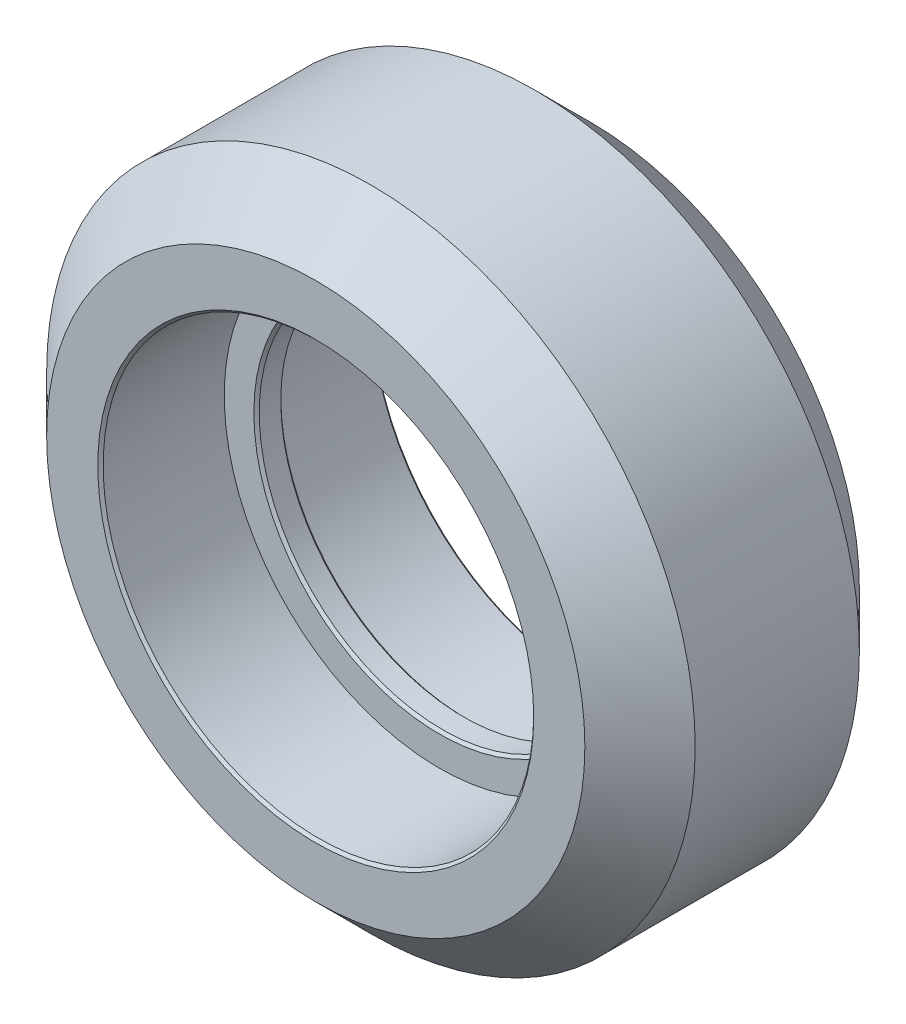
ISO-10303-21;
HEADER;
FILE_DESCRIPTION(('STEP AP214'),'2;1');
FILE_NAME('part.step','',(''),(''),'','','');
FILE_SCHEMA(('AUTOMOTIVE_DESIGN { 1 0 10303 214 1 1 1 1 }'));
ENDSEC;
DATA;
#1=APPLICATION_CONTEXT('core data for automotive mechanical design processes');
#2=APPLICATION_PROTOCOL_DEFINITION('international standard','automotive_design',2000,#1);
#3=PRODUCT_CONTEXT('',#1,'mechanical');
#4=PRODUCT('Part','Part','',(#3));
#5=PRODUCT_RELATED_PRODUCT_CATEGORY('part','',(#4));
#6=PRODUCT_DEFINITION_FORMATION('','',#4);
#7=PRODUCT_DEFINITION_CONTEXT('part definition',#1,'design');
#8=PRODUCT_DEFINITION('design','',#6,#7);
#9=PRODUCT_DEFINITION_SHAPE('','',#8);
#10=(LENGTH_UNIT() NAMED_UNIT(*) SI_UNIT(.MILLI.,.METRE.));
#11=(NAMED_UNIT(*) PLANE_ANGLE_UNIT() SI_UNIT($,.RADIAN.));
#12=(NAMED_UNIT(*) SI_UNIT($,.STERADIAN.) SOLID_ANGLE_UNIT());
#13=UNCERTAINTY_MEASURE_WITH_UNIT(LENGTH_MEASURE(1.E-05),#10,'distance_accuracy_value','');
#14=(GEOMETRIC_REPRESENTATION_CONTEXT(3) GLOBAL_UNCERTAINTY_ASSIGNED_CONTEXT((#13)) GLOBAL_UNIT_ASSIGNED_CONTEXT((#10,
#11,#12)) REPRESENTATION_CONTEXT('',''));
#15=CARTESIAN_POINT('',(0.,0.,0.));
#16=DIRECTION('',(0.,0.,1.));
#17=DIRECTION('',(1.,0.,0.));
#18=AXIS2_PLACEMENT_3D('',#15,#16,#17);
#19=CARTESIAN_POINT('',(15.5,-35.5,-38.35));
#20=DIRECTION('',(0.,0.,1.));
#21=DIRECTION('',(1.,0.,0.));
#22=AXIS2_PLACEMENT_3D('',#19,#20,#21);
#23=CYLINDRICAL_SURFACE('',#22,6.8);
#24=CARTESIAN_POINT('',(15.5,-35.5,-13.8499999999908));
#25=DIRECTION('',(0.,0.,-1.));
#26=DIRECTION('',(-1.,0.,0.));
#27=AXIS2_PLACEMENT_3D('',#24,#25,#26);
#28=CIRCLE('',#27,6.79999999991014);
#29=CARTESIAN_POINT('',(8.70000000008986,-35.5,-13.8499999999908));
#30=VERTEX_POINT('',#29);
#31=EDGE_CURVE('E42',#30,#30,#28,.T.);
#32=ORIENTED_EDGE('',*,*,#31,.T.);
#33=EDGE_LOOP('',(#32));
#34=FACE_BOUND('',#33,.T.);
#35=CARTESIAN_POINT('',(15.5,-35.5,-13.0500000000211));
#36=DIRECTION('',(0.,0.,1.));
#37=DIRECTION('',(1.,0.,0.));
#38=AXIS2_PLACEMENT_3D('',#35,#36,#37);
#39=CIRCLE('',#38,6.7999999999729);
#40=CARTESIAN_POINT('',(22.2999999999729,-35.5,-13.0500000000211));
#41=VERTEX_POINT('',#40);
#42=EDGE_CURVE('E39',#41,#41,#39,.T.);
#43=ORIENTED_EDGE('',*,*,#42,.T.);
#44=EDGE_LOOP('',(#43));
#45=FACE_BOUND('',#44,.T.);
#46=ADVANCED_FACE('F16',(#34,#45),#23,.F.);
#47=CARTESIAN_POINT('',(15.5,-35.5,-13.9499999999089));
#48=DIRECTION('',(0.,0.,-1.));
#49=DIRECTION('',(-1.,0.,0.));
#50=AXIS2_PLACEMENT_3D('',#47,#48,#49);
#51=CONICAL_SURFACE('',#50,6.8999999998282,0.785398163397448);
#52=ORIENTED_EDGE('',*,*,#31,.F.);
#53=EDGE_LOOP('',(#52));
#54=FACE_BOUND('',#53,.T.);
#55=CARTESIAN_POINT('',(15.5,-35.5,-13.9500000000226));
#56=DIRECTION('',(0.,0.,-1.));
#57=DIRECTION('',(-1.,0.,0.));
#58=AXIS2_PLACEMENT_3D('',#55,#56,#57);
#59=CIRCLE('',#58,6.89999999994188);
#60=CARTESIAN_POINT('',(8.60000000005812,-35.5,-13.9500000000226));
#61=VERTEX_POINT('',#60);
#62=EDGE_CURVE('E19',#61,#61,#59,.F.);
#63=ORIENTED_EDGE('',*,*,#62,.F.);
#64=EDGE_LOOP('',(#63));
#65=FACE_BOUND('',#64,.T.);
#66=ADVANCED_FACE('F68',(#54,#65),#51,.F.);
#67=CARTESIAN_POINT('',(15.5,-35.5,-12.950000000103));
#68=DIRECTION('',(0.,0.,1.));
#69=DIRECTION('',(1.,0.,0.));
#70=AXIS2_PLACEMENT_3D('',#67,#68,#69);
#71=CONICAL_SURFACE('',#70,6.89999999989095,0.785398163397448);
#72=ORIENTED_EDGE('',*,*,#42,.F.);
#73=EDGE_LOOP('',(#72));
#74=FACE_BOUND('',#73,.T.);
#75=CARTESIAN_POINT('',(15.5,-35.5,-12.9499999999894));
#76=DIRECTION('',(0.,0.,1.));
#77=DIRECTION('',(1.,0.,0.));
#78=AXIS2_PLACEMENT_3D('',#75,#76,#77);
#79=CIRCLE('',#78,6.90000000000464);
#80=CARTESIAN_POINT('',(22.4000000000046,-35.5,-12.9499999999894));
#81=VERTEX_POINT('',#80);
#82=EDGE_CURVE('E59',#81,#81,#79,.F.);
#83=ORIENTED_EDGE('',*,*,#82,.F.);
#84=EDGE_LOOP('',(#83));
#85=FACE_BOUND('',#84,.T.);
#86=ADVANCED_FACE('F70',(#74,#85),#71,.F.);
#87=CARTESIAN_POINT('',(15.5,-35.5,-13.95));
#88=DIRECTION('',(0.,0.,-1.));
#89=DIRECTION('',(-1.,0.,0.));
#90=AXIS2_PLACEMENT_3D('',#87,#88,#89);
#91=PLANE('',#90);
#92=CARTESIAN_POINT('',(15.5,-35.5,-13.95));
#93=DIRECTION('',(0.,0.,-1.));
#94=DIRECTION('',(-1.,0.,0.));
#95=AXIS2_PLACEMENT_3D('',#92,#93,#94);
#96=CIRCLE('',#95,8.);
#97=CARTESIAN_POINT('',(7.5,-35.5,-13.95));
#98=VERTEX_POINT('',#97);
#99=EDGE_CURVE('E57',#98,#98,#96,.T.);
#100=ORIENTED_EDGE('',*,*,#99,.T.);
#101=EDGE_LOOP('',(#100));
#102=FACE_BOUND('',#101,.T.);
#103=ORIENTED_EDGE('',*,*,#62,.T.);
#104=EDGE_LOOP('',(#103));
#105=FACE_BOUND('',#104,.T.);
#106=ADVANCED_FACE('F66',(#102,#105),#91,.T.);
#107=CARTESIAN_POINT('',(15.5,-35.5,-12.95));
#108=DIRECTION('',(0.,0.,1.));
#109=DIRECTION('',(1.,0.,0.));
#110=AXIS2_PLACEMENT_3D('',#107,#108,#109);
#111=PLANE('',#110);
#112=CARTESIAN_POINT('',(15.5,-35.5,-12.95));
#113=DIRECTION('',(0.,0.,1.));
#114=DIRECTION('',(1.,0.,0.));
#115=AXIS2_PLACEMENT_3D('',#112,#113,#114);
#116=CIRCLE('',#115,8.);
#117=CARTESIAN_POINT('',(23.5,-35.5,-12.95));
#118=VERTEX_POINT('',#117);
#119=EDGE_CURVE('E38',#118,#118,#116,.T.);
#120=ORIENTED_EDGE('',*,*,#119,.T.);
#121=EDGE_LOOP('',(#120));
#122=FACE_BOUND('',#121,.T.);
#123=ORIENTED_EDGE('',*,*,#82,.T.);
#124=EDGE_LOOP('',(#123));
#125=FACE_BOUND('',#124,.T.);
#126=ADVANCED_FACE('F119',(#122,#125),#111,.T.);
#127=CARTESIAN_POINT('',(15.5,-35.5,-13.95));
#128=DIRECTION('',(0.,0.,-1.));
#129=DIRECTION('',(-1.,0.,0.));
#130=AXIS2_PLACEMENT_3D('',#127,#128,#129);
#131=CYLINDRICAL_SURFACE('',#130,8.);
#132=CARTESIAN_POINT('',(15.5,-35.5,-18.45));
#133=DIRECTION('',(0.,0.,-1.));
#134=DIRECTION('',(-1.,0.,0.));
#135=AXIS2_PLACEMENT_3D('',#132,#133,#134);
#136=CIRCLE('',#135,8.);
#137=CARTESIAN_POINT('',(7.5,-35.5,-18.45));
#138=VERTEX_POINT('',#137);
#139=EDGE_CURVE('E35',#138,#138,#136,.T.);
#140=ORIENTED_EDGE('',*,*,#139,.T.);
#141=EDGE_LOOP('',(#140));
#142=FACE_BOUND('',#141,.T.);
#143=ORIENTED_EDGE('',*,*,#99,.F.);
#144=EDGE_LOOP('',(#143));
#145=FACE_BOUND('',#144,.T.);
#146=ADVANCED_FACE('F115',(#142,#145),#131,.F.);
#147=CARTESIAN_POINT('',(15.5,-35.5,-12.95));
#148=DIRECTION('',(0.,0.,1.));
#149=DIRECTION('',(1.,0.,0.));
#150=AXIS2_PLACEMENT_3D('',#147,#148,#149);
#151=CYLINDRICAL_SURFACE('',#150,8.);
#152=ORIENTED_EDGE('',*,*,#119,.F.);
#153=EDGE_LOOP('',(#152));
#154=FACE_BOUND('',#153,.T.);
#155=CARTESIAN_POINT('',(15.5,-35.5,-8.45));
#156=DIRECTION('',(0.,0.,1.));
#157=DIRECTION('',(1.,0.,0.));
#158=AXIS2_PLACEMENT_3D('',#155,#156,#157);
#159=CIRCLE('',#158,8.);
#160=CARTESIAN_POINT('',(23.5,-35.5,-8.45));
#161=VERTEX_POINT('',#160);
#162=EDGE_CURVE('E31',#161,#161,#159,.T.);
#163=ORIENTED_EDGE('',*,*,#162,.T.);
#164=EDGE_LOOP('',(#163));
#165=FACE_BOUND('',#164,.T.);
#166=ADVANCED_FACE('F111',(#154,#165),#151,.F.);
#167=CARTESIAN_POINT('',(15.5,-35.5,-18.55));
#168=DIRECTION('',(0.,0.,-1.));
#169=DIRECTION('',(-1.,0.,0.));
#170=AXIS2_PLACEMENT_3D('',#167,#168,#169);
#171=CONICAL_SURFACE('',#170,8.1,0.785398163397448);
#172=CARTESIAN_POINT('',(15.5,-35.5,-18.55));
#173=DIRECTION('',(0.,0.,-1.));
#174=DIRECTION('',(-1.,0.,0.));
#175=AXIS2_PLACEMENT_3D('',#172,#173,#174);
#176=CIRCLE('',#175,8.1);
#177=CARTESIAN_POINT('',(7.4,-35.5,-18.55));
#178=VERTEX_POINT('',#177);
#179=EDGE_CURVE('E34',#178,#178,#176,.T.);
#180=ORIENTED_EDGE('',*,*,#179,.T.);
#181=EDGE_LOOP('',(#180));
#182=FACE_BOUND('',#181,.T.);
#183=ORIENTED_EDGE('',*,*,#139,.F.);
#184=EDGE_LOOP('',(#183));
#185=FACE_BOUND('',#184,.T.);
#186=ADVANCED_FACE('F107',(#182,#185),#171,.F.);
#187=CARTESIAN_POINT('',(15.5,-35.5,-8.35));
#188=DIRECTION('',(0.,0.,1.));
#189=DIRECTION('',(1.,0.,0.));
#190=AXIS2_PLACEMENT_3D('',#187,#188,#189);
#191=CONICAL_SURFACE('',#190,8.1,0.785398163397448);
#192=ORIENTED_EDGE('',*,*,#162,.F.);
#193=EDGE_LOOP('',(#192));
#194=FACE_BOUND('',#193,.T.);
#195=CARTESIAN_POINT('',(15.5,-35.5,-8.35));
#196=DIRECTION('',(0.,0.,1.));
#197=DIRECTION('',(1.,0.,0.));
#198=AXIS2_PLACEMENT_3D('',#195,#196,#197);
#199=CIRCLE('',#198,8.1);
#200=CARTESIAN_POINT('',(23.6,-35.5,-8.35));
#201=VERTEX_POINT('',#200);
#202=EDGE_CURVE('E50',#201,#201,#199,.F.);
#203=ORIENTED_EDGE('',*,*,#202,.F.);
#204=EDGE_LOOP('',(#203));
#205=FACE_BOUND('',#204,.T.);
#206=ADVANCED_FACE('F103',(#194,#205),#191,.F.);
#207=CARTESIAN_POINT('',(15.5,-35.5,-18.55));
#208=DIRECTION('',(0.,0.,1.));
#209=DIRECTION('',(1.,0.,0.));
#210=AXIS2_PLACEMENT_3D('',#207,#208,#209);
#211=PLANE('',#210);
#212=CARTESIAN_POINT('',(15.5,-35.5,-18.55));
#213=DIRECTION('',(0.,0.,1.));
#214=DIRECTION('',(1.,0.,0.));
#215=AXIS2_PLACEMENT_3D('',#212,#213,#214);
#216=CIRCLE('',#215,10.);
#217=CARTESIAN_POINT('',(25.5,-35.5,-18.55));
#218=VERTEX_POINT('',#217);
#219=EDGE_CURVE('E47',#218,#218,#216,.T.);
#220=ORIENTED_EDGE('',*,*,#219,.F.);
#221=EDGE_LOOP('',(#220));
#222=FACE_BOUND('',#221,.T.);
#223=ORIENTED_EDGE('',*,*,#179,.F.);
#224=EDGE_LOOP('',(#223));
#225=FACE_BOUND('',#224,.T.);
#226=ADVANCED_FACE('F99',(#222,#225),#211,.F.);
#227=CARTESIAN_POINT('',(15.5,-35.5,-8.35));
#228=DIRECTION('',(0.,0.,1.));
#229=DIRECTION('',(1.,0.,0.));
#230=AXIS2_PLACEMENT_3D('',#227,#228,#229);
#231=PLANE('',#230);
#232=CARTESIAN_POINT('',(15.5,-35.5,-8.35));
#233=DIRECTION('',(0.,0.,-1.));
#234=DIRECTION('',(-1.,0.,0.));
#235=AXIS2_PLACEMENT_3D('',#232,#233,#234);
#236=CIRCLE('',#235,10.);
#237=CARTESIAN_POINT('',(5.5,-35.5,-8.35));
#238=VERTEX_POINT('',#237);
#239=EDGE_CURVE('E28',#238,#238,#236,.T.);
#240=ORIENTED_EDGE('',*,*,#239,.F.);
#241=EDGE_LOOP('',(#240));
#242=FACE_BOUND('',#241,.T.);
#243=ORIENTED_EDGE('',*,*,#202,.T.);
#244=EDGE_LOOP('',(#243));
#245=FACE_BOUND('',#244,.T.);
#246=ADVANCED_FACE('F95',(#242,#245),#231,.T.);
#247=CARTESIAN_POINT('',(15.5,-35.5,-16.5));
#248=DIRECTION('',(0.,0.,1.));
#249=DIRECTION('',(1.,0.,0.));
#250=AXIS2_PLACEMENT_3D('',#247,#248,#249);
#251=CONICAL_SURFACE('',#250,12.05,0.785398163397448);
#252=CARTESIAN_POINT('',(15.5,-35.5,-16.5));
#253=DIRECTION('',(0.,0.,1.));
#254=DIRECTION('',(1.,0.,0.));
#255=AXIS2_PLACEMENT_3D('',#252,#253,#254);
#256=CIRCLE('',#255,12.05);
#257=CARTESIAN_POINT('',(27.55,-35.5,-16.5));
#258=VERTEX_POINT('',#257);
#259=EDGE_CURVE('E23',#258,#258,#256,.T.);
#260=ORIENTED_EDGE('',*,*,#259,.F.);
#261=EDGE_LOOP('',(#260));
#262=FACE_BOUND('',#261,.T.);
#263=ORIENTED_EDGE('',*,*,#219,.T.);
#264=EDGE_LOOP('',(#263));
#265=FACE_BOUND('',#264,.T.);
#266=ADVANCED_FACE('F88',(#262,#265),#251,.T.);
#267=CARTESIAN_POINT('',(15.5,-35.5,-10.4));
#268=DIRECTION('',(0.,0.,-1.));
#269=DIRECTION('',(-1.,0.,0.));
#270=AXIS2_PLACEMENT_3D('',#267,#268,#269);
#271=CONICAL_SURFACE('',#270,12.05,0.785398163397448);
#272=CARTESIAN_POINT('',(15.5,-35.5,-10.4));
#273=DIRECTION('',(0.,0.,1.));
#274=DIRECTION('',(1.,0.,0.));
#275=AXIS2_PLACEMENT_3D('',#272,#273,#274);
#276=CIRCLE('',#275,12.05);
#277=CARTESIAN_POINT('',(27.55,-35.5,-10.4));
#278=VERTEX_POINT('',#277);
#279=EDGE_CURVE('E10',#278,#278,#276,.F.);
#280=ORIENTED_EDGE('',*,*,#279,.F.);
#281=EDGE_LOOP('',(#280));
#282=FACE_BOUND('',#281,.T.);
#283=ORIENTED_EDGE('',*,*,#239,.T.);
#284=EDGE_LOOP('',(#283));
#285=FACE_BOUND('',#284,.T.);
#286=ADVANCED_FACE('F83',(#282,#285),#271,.T.);
#287=CARTESIAN_POINT('',(15.5,-35.5,-16.));
#288=DIRECTION('',(0.,0.,1.));
#289=DIRECTION('',(1.,0.,0.));
#290=AXIS2_PLACEMENT_3D('',#287,#288,#289);
#291=CYLINDRICAL_SURFACE('',#290,12.05);
#292=ORIENTED_EDGE('',*,*,#279,.T.);
#293=EDGE_LOOP('',(#292));
#294=FACE_BOUND('',#293,.T.);
#295=ORIENTED_EDGE('',*,*,#259,.T.);
#296=EDGE_LOOP('',(#295));
#297=FACE_BOUND('',#296,.T.);
#298=ADVANCED_FACE('F81',(#294,#297),#291,.T.);
#299=CLOSED_SHELL('',(#46,#66,#86,#106,#126,#146,#166,#186,#206,#226,#246,#266,#286,#298));
#300=MANIFOLD_SOLID_BREP('B1',#299);
#301=ADVANCED_BREP_SHAPE_REPRESENTATION('',(#18,#300),#14);
#302=SHAPE_DEFINITION_REPRESENTATION(#9,#301);
ENDSEC;
END-ISO-10303-21;
